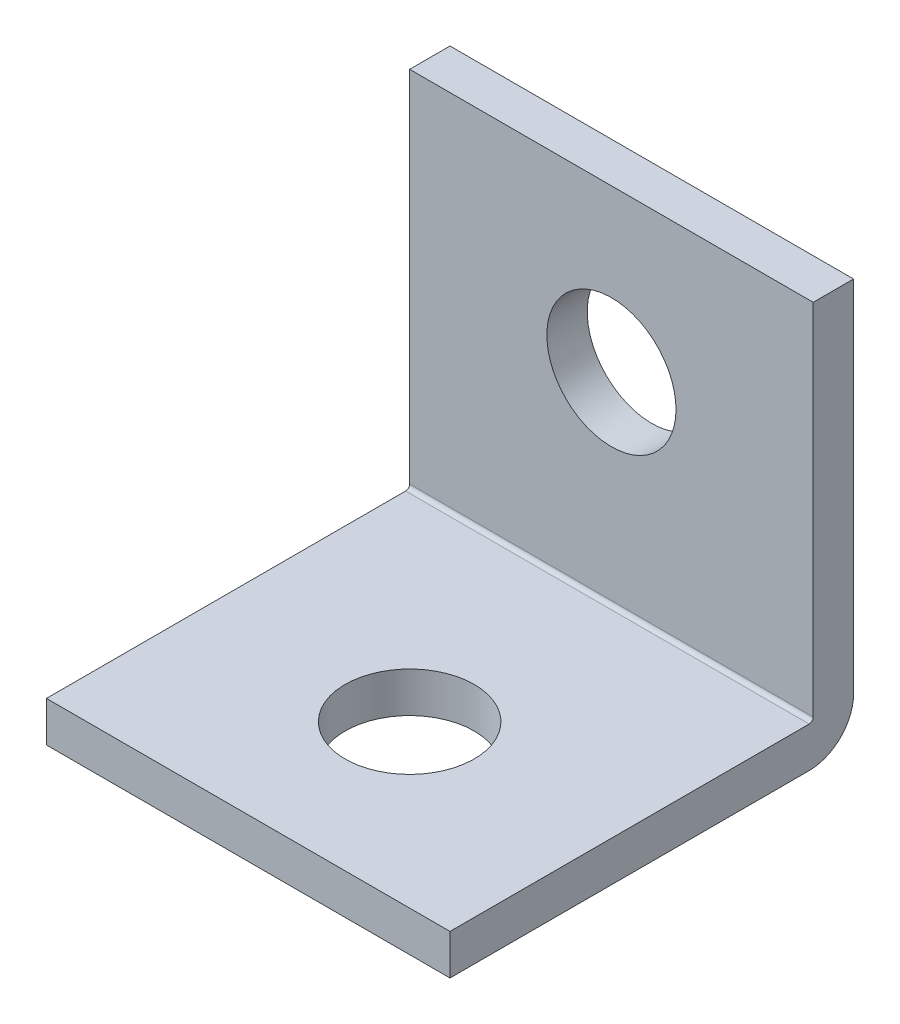
ISO-10303-21;
HEADER;
FILE_DESCRIPTION(('STEP AP214'),'2;1');
FILE_NAME('part.step','',(''),(''),'','','');
FILE_SCHEMA(('AUTOMOTIVE_DESIGN { 1 0 10303 214 1 1 1 1 }'));
ENDSEC;
DATA;
#1=APPLICATION_CONTEXT('core data for automotive mechanical design processes');
#2=APPLICATION_PROTOCOL_DEFINITION('international standard','automotive_design',2000,#1);
#3=PRODUCT_CONTEXT('',#1,'mechanical');
#4=PRODUCT('Part','Part','',(#3));
#5=PRODUCT_RELATED_PRODUCT_CATEGORY('part','',(#4));
#6=PRODUCT_DEFINITION_FORMATION('','',#4);
#7=PRODUCT_DEFINITION_CONTEXT('part definition',#1,'design');
#8=PRODUCT_DEFINITION('design','',#6,#7);
#9=PRODUCT_DEFINITION_SHAPE('','',#8);
#10=(LENGTH_UNIT() NAMED_UNIT(*) SI_UNIT(.MILLI.,.METRE.));
#11=(NAMED_UNIT(*) PLANE_ANGLE_UNIT() SI_UNIT($,.RADIAN.));
#12=(NAMED_UNIT(*) SI_UNIT($,.STERADIAN.) SOLID_ANGLE_UNIT());
#13=UNCERTAINTY_MEASURE_WITH_UNIT(LENGTH_MEASURE(1.E-05),#10,'distance_accuracy_value','');
#14=(GEOMETRIC_REPRESENTATION_CONTEXT(3) GLOBAL_UNCERTAINTY_ASSIGNED_CONTEXT((#13)) GLOBAL_UNIT_ASSIGNED_CONTEXT((#10,
#11,#12)) REPRESENTATION_CONTEXT('',''));
#15=CARTESIAN_POINT('',(0.,0.,0.));
#16=DIRECTION('',(0.,0.,1.));
#17=DIRECTION('',(1.,0.,0.));
#18=AXIS2_PLACEMENT_3D('',#15,#16,#17);
#19=CARTESIAN_POINT('',(0.,-5.,5.12588499176538));
#20=DIRECTION('',(0.,1.,0.));
#21=DIRECTION('',(0.,0.,1.));
#22=AXIS2_PLACEMENT_3D('',#19,#20,#21);
#23=PLANE('',#22);
#24=CARTESIAN_POINT('',(0.,-5.,6.));
#25=DIRECTION('',(0.,-1.,0.));
#26=DIRECTION('',(0.,0.,-1.));
#27=AXIS2_PLACEMENT_3D('',#24,#25,#26);
#28=CIRCLE('',#27,1.6);
#29=CARTESIAN_POINT('',(0.,-5.,4.4));
#30=VERTEX_POINT('',#29);
#31=EDGE_CURVE('E142',#30,#30,#28,.F.);
#32=ORIENTED_EDGE('',*,*,#31,.T.);
#33=EDGE_LOOP('',(#32));
#34=FACE_BOUND('',#33,.T.);
#35=DIRECTION('',(0.,0.,-1.));
#36=VECTOR('',#35,1.);
#37=CARTESIAN_POINT('',(5.,-5.,1.1));
#38=LINE('',#37,#36);
#39=CARTESIAN_POINT('',(4.99999999999999,-5.,10.));
#40=VERTEX_POINT('',#39);
#41=CARTESIAN_POINT('',(5.,-5.,1.1));
#42=VERTEX_POINT('',#41);
#43=EDGE_CURVE('E144',#40,#42,#38,.T.);
#44=ORIENTED_EDGE('',*,*,#43,.F.);
#45=DIRECTION('',(1.,0.,0.));
#46=VECTOR('',#45,1.);
#47=CARTESIAN_POINT('',(-5.,-5.,10.));
#48=LINE('',#47,#46);
#49=CARTESIAN_POINT('',(-5.,-5.,10.));
#50=VERTEX_POINT('',#49);
#51=EDGE_CURVE('E118',#50,#40,#48,.T.);
#52=ORIENTED_EDGE('',*,*,#51,.F.);
#53=DIRECTION('',(0.,0.,1.));
#54=VECTOR('',#53,1.);
#55=CARTESIAN_POINT('',(-5.,-5.,1.1));
#56=LINE('',#55,#54);
#57=CARTESIAN_POINT('',(-5.,-5.,1.1));
#58=VERTEX_POINT('',#57);
#59=EDGE_CURVE('E116',#58,#50,#56,.T.);
#60=ORIENTED_EDGE('',*,*,#59,.F.);
#61=DIRECTION('',(-1.,0.,0.));
#62=VECTOR('',#61,1.);
#63=CARTESIAN_POINT('',(0.,-5.,1.1));
#64=LINE('',#63,#62);
#65=EDGE_CURVE('E141',#42,#58,#64,.T.);
#66=ORIENTED_EDGE('',*,*,#65,.F.);
#67=EDGE_LOOP('',(#44,#52,#60,#66));
#68=FACE_BOUND('',#67,.T.);
#69=ADVANCED_FACE('F17',(#34,#68),#23,.F.);
#70=CARTESIAN_POINT('',(-5.,-4.,10.));
#71=DIRECTION('',(0.,0.,1.));
#72=DIRECTION('',(0.,-1.,0.));
#73=AXIS2_PLACEMENT_3D('',#70,#71,#72);
#74=PLANE('',#73);
#75=DIRECTION('',(1.,0.,0.));
#76=VECTOR('',#75,1.);
#77=CARTESIAN_POINT('',(0.,-4.,10.));
#78=LINE('',#77,#76);
#79=CARTESIAN_POINT('',(-5.,-4.,10.));
#80=VERTEX_POINT('',#79);
#81=CARTESIAN_POINT('',(4.99999999999999,-4.,10.));
#82=VERTEX_POINT('',#81);
#83=EDGE_CURVE('E97',#80,#82,#78,.T.);
#84=ORIENTED_EDGE('',*,*,#83,.F.);
#85=DIRECTION('',(0.,-1.,0.));
#86=VECTOR('',#85,1.);
#87=CARTESIAN_POINT('',(-5.,-4.,10.));
#88=LINE('',#87,#86);
#89=EDGE_CURVE('E93',#80,#50,#88,.T.);
#90=ORIENTED_EDGE('',*,*,#89,.T.);
#91=ORIENTED_EDGE('',*,*,#51,.T.);
#92=DIRECTION('',(0.,1.,0.));
#93=VECTOR('',#92,1.);
#94=CARTESIAN_POINT('',(4.99999999999999,-4.,10.));
#95=LINE('',#94,#93);
#96=EDGE_CURVE('E122',#82,#40,#95,.F.);
#97=ORIENTED_EDGE('',*,*,#96,.F.);
#98=EDGE_LOOP('',(#84,#90,#91,#97));
#99=FACE_BOUND('',#98,.T.);
#100=ADVANCED_FACE('F178',(#99),#74,.T.);
#101=CARTESIAN_POINT('',(0.,-4.,6.));
#102=DIRECTION('',(0.,-1.,0.));
#103=DIRECTION('',(0.,0.,-1.));
#104=AXIS2_PLACEMENT_3D('',#101,#102,#103);
#105=CYLINDRICAL_SURFACE('',#104,1.6);
#106=ORIENTED_EDGE('',*,*,#31,.F.);
#107=EDGE_LOOP('',(#106));
#108=FACE_BOUND('',#107,.T.);
#109=CARTESIAN_POINT('',(0.,-4.,6.));
#110=DIRECTION('',(0.,-1.,0.));
#111=DIRECTION('',(0.,0.,-1.));
#112=AXIS2_PLACEMENT_3D('',#109,#110,#111);
#113=CIRCLE('',#112,1.6);
#114=CARTESIAN_POINT('',(0.,-4.,4.4));
#115=VERTEX_POINT('',#114);
#116=EDGE_CURVE('E110',#115,#115,#113,.T.);
#117=ORIENTED_EDGE('',*,*,#116,.F.);
#118=EDGE_LOOP('',(#117));
#119=FACE_BOUND('',#118,.T.);
#120=ADVANCED_FACE('F224',(#108,#119),#105,.F.);
#121=CARTESIAN_POINT('',(0.,-3.9,1.1));
#122=DIRECTION('',(-1.,0.,0.));
#123=DIRECTION('',(0.,0.,1.));
#124=AXIS2_PLACEMENT_3D('',#121,#122,#123);
#125=CYLINDRICAL_SURFACE('',#124,1.1);
#126=DIRECTION('',(1.,0.,0.));
#127=VECTOR('',#126,1.);
#128=CARTESIAN_POINT('',(0.,-3.9,0.));
#129=LINE('',#128,#127);
#130=CARTESIAN_POINT('',(-5.,-3.9,0.));
#131=VERTEX_POINT('',#130);
#132=CARTESIAN_POINT('',(5.,-3.9,0.));
#133=VERTEX_POINT('',#132);
#134=EDGE_CURVE('E105',#131,#133,#129,.T.);
#135=ORIENTED_EDGE('',*,*,#134,.T.);
#136=CARTESIAN_POINT('',(5.,-3.9,1.1));
#137=DIRECTION('',(-1.,0.,0.));
#138=DIRECTION('',(0.,0.,1.));
#139=AXIS2_PLACEMENT_3D('',#136,#137,#138);
#140=CIRCLE('',#139,1.1);
#141=EDGE_CURVE('E98',#133,#42,#140,.T.);
#142=ORIENTED_EDGE('',*,*,#141,.T.);
#143=ORIENTED_EDGE('',*,*,#65,.T.);
#144=CARTESIAN_POINT('',(-5.,-3.9,1.1));
#145=DIRECTION('',(-1.,0.,0.));
#146=DIRECTION('',(0.,0.,1.));
#147=AXIS2_PLACEMENT_3D('',#144,#145,#146);
#148=CIRCLE('',#147,1.1);
#149=EDGE_CURVE('E139',#58,#131,#148,.F.);
#150=ORIENTED_EDGE('',*,*,#149,.T.);
#151=EDGE_LOOP('',(#135,#142,#143,#150));
#152=FACE_BOUND('',#151,.T.);
#153=ADVANCED_FACE('F183',(#152),#125,.T.);
#154=CARTESIAN_POINT('',(0.,-4.,5.12588499176538));
#155=DIRECTION('',(0.,1.,0.));
#156=DIRECTION('',(0.,0.,1.));
#157=AXIS2_PLACEMENT_3D('',#154,#155,#156);
#158=PLANE('',#157);
#159=ORIENTED_EDGE('',*,*,#116,.T.);
#160=EDGE_LOOP('',(#159));
#161=FACE_BOUND('',#160,.T.);
#162=ORIENTED_EDGE('',*,*,#83,.T.);
#163=DIRECTION('',(0.,0.,1.));
#164=VECTOR('',#163,1.);
#165=CARTESIAN_POINT('',(5.,-4.,5.12588499176538));
#166=LINE('',#165,#164);
#167=CARTESIAN_POINT('',(5.,-4.,1.1));
#168=VERTEX_POINT('',#167);
#169=EDGE_CURVE('E103',#82,#168,#166,.F.);
#170=ORIENTED_EDGE('',*,*,#169,.T.);
#171=DIRECTION('',(-1.,0.,0.));
#172=VECTOR('',#171,1.);
#173=CARTESIAN_POINT('',(0.,-4.,1.1));
#174=LINE('',#173,#172);
#175=CARTESIAN_POINT('',(-5.,-4.,1.1));
#176=VERTEX_POINT('',#175);
#177=EDGE_CURVE('E83',#168,#176,#174,.T.);
#178=ORIENTED_EDGE('',*,*,#177,.T.);
#179=DIRECTION('',(0.,0.,1.));
#180=VECTOR('',#179,1.);
#181=CARTESIAN_POINT('',(-5.,-4.,5.12588499176538));
#182=LINE('',#181,#180);
#183=EDGE_CURVE('E89',#176,#80,#182,.T.);
#184=ORIENTED_EDGE('',*,*,#183,.T.);
#185=EDGE_LOOP('',(#162,#170,#178,#184));
#186=FACE_BOUND('',#185,.T.);
#187=ADVANCED_FACE('F101',(#161,#186),#158,.T.);
#188=CARTESIAN_POINT('',(0.,0.,0.));
#189=DIRECTION('',(0.,0.,1.));
#190=DIRECTION('',(1.,0.,0.));
#191=AXIS2_PLACEMENT_3D('',#188,#189,#190);
#192=PLANE('',#191);
#193=CARTESIAN_POINT('',(0.,1.,0.));
#194=DIRECTION('',(0.,0.,1.));
#195=DIRECTION('',(1.,0.,0.));
#196=AXIS2_PLACEMENT_3D('',#193,#194,#195);
#197=CIRCLE('',#196,1.6);
#198=CARTESIAN_POINT('',(1.6,1.,0.));
#199=VERTEX_POINT('',#198);
#200=EDGE_CURVE('E130',#199,#199,#197,.T.);
#201=ORIENTED_EDGE('',*,*,#200,.T.);
#202=EDGE_LOOP('',(#201));
#203=FACE_BOUND('',#202,.T.);
#204=DIRECTION('',(0.,-1.,0.));
#205=VECTOR('',#204,1.);
#206=CARTESIAN_POINT('',(-5.,-5.,0.));
#207=LINE('',#206,#205);
#208=CARTESIAN_POINT('',(-5.,5.,0.));
#209=VERTEX_POINT('',#208);
#210=EDGE_CURVE('E135',#209,#131,#207,.T.);
#211=ORIENTED_EDGE('',*,*,#210,.F.);
#212=DIRECTION('',(1.,0.,0.));
#213=VECTOR('',#212,1.);
#214=CARTESIAN_POINT('',(-5.,5.,0.));
#215=LINE('',#214,#213);
#216=CARTESIAN_POINT('',(5.,5.,0.));
#217=VERTEX_POINT('',#216);
#218=EDGE_CURVE('E155',#217,#209,#215,.F.);
#219=ORIENTED_EDGE('',*,*,#218,.F.);
#220=DIRECTION('',(0.,1.,0.));
#221=VECTOR('',#220,1.);
#222=CARTESIAN_POINT('',(5.,5.,0.));
#223=LINE('',#222,#221);
#224=EDGE_CURVE('E104',#133,#217,#223,.T.);
#225=ORIENTED_EDGE('',*,*,#224,.F.);
#226=ORIENTED_EDGE('',*,*,#134,.F.);
#227=EDGE_LOOP('',(#211,#219,#225,#226));
#228=FACE_BOUND('',#227,.T.);
#229=ADVANCED_FACE('F188',(#203,#228),#192,.F.);
#230=CARTESIAN_POINT('',(0.,-3.9,1.1));
#231=DIRECTION('',(-1.,0.,0.));
#232=DIRECTION('',(0.,0.,1.));
#233=AXIS2_PLACEMENT_3D('',#230,#231,#232);
#234=CYLINDRICAL_SURFACE('',#233,0.1);
#235=CARTESIAN_POINT('',(5.,-3.9,1.1));
#236=DIRECTION('',(-1.,0.,0.));
#237=DIRECTION('',(0.,0.,1.));
#238=AXIS2_PLACEMENT_3D('',#235,#236,#237);
#239=CIRCLE('',#238,0.1);
#240=CARTESIAN_POINT('',(5.,-3.9,1.));
#241=VERTEX_POINT('',#240);
#242=EDGE_CURVE('E87',#241,#168,#239,.T.);
#243=ORIENTED_EDGE('',*,*,#242,.F.);
#244=DIRECTION('',(1.,0.,0.));
#245=VECTOR('',#244,1.);
#246=CARTESIAN_POINT('',(0.,-3.9,1.));
#247=LINE('',#246,#245);
#248=CARTESIAN_POINT('',(-5.,-3.9,1.));
#249=VERTEX_POINT('',#248);
#250=EDGE_CURVE('E85',#249,#241,#247,.T.);
#251=ORIENTED_EDGE('',*,*,#250,.F.);
#252=CARTESIAN_POINT('',(-5.,-3.9,1.1));
#253=DIRECTION('',(-1.,0.,0.));
#254=DIRECTION('',(0.,0.,1.));
#255=AXIS2_PLACEMENT_3D('',#252,#253,#254);
#256=CIRCLE('',#255,0.1);
#257=EDGE_CURVE('E20',#176,#249,#256,.F.);
#258=ORIENTED_EDGE('',*,*,#257,.F.);
#259=ORIENTED_EDGE('',*,*,#177,.F.);
#260=EDGE_LOOP('',(#243,#251,#258,#259));
#261=FACE_BOUND('',#260,.T.);
#262=ADVANCED_FACE('F81',(#261),#234,.F.);
#263=CARTESIAN_POINT('',(5.,5.,0.));
#264=DIRECTION('',(1.,0.,0.));
#265=DIRECTION('',(0.,1.,0.));
#266=AXIS2_PLACEMENT_3D('',#263,#264,#265);
#267=PLANE('',#266);
#268=DIRECTION('',(0.,0.,1.));
#269=VECTOR('',#268,1.);
#270=CARTESIAN_POINT('',(5.,5.,0.));
#271=LINE('',#270,#269);
#272=CARTESIAN_POINT('',(5.,5.,1.));
#273=VERTEX_POINT('',#272);
#274=EDGE_CURVE('E107',#273,#217,#271,.F.);
#275=ORIENTED_EDGE('',*,*,#274,.F.);
#276=DIRECTION('',(0.,1.,0.));
#277=VECTOR('',#276,1.);
#278=CARTESIAN_POINT('',(5.,0.,1.));
#279=LINE('',#278,#277);
#280=EDGE_CURVE('E125',#241,#273,#279,.T.);
#281=ORIENTED_EDGE('',*,*,#280,.F.);
#282=ORIENTED_EDGE('',*,*,#242,.T.);
#283=ORIENTED_EDGE('',*,*,#169,.F.);
#284=ORIENTED_EDGE('',*,*,#96,.T.);
#285=ORIENTED_EDGE('',*,*,#43,.T.);
#286=ORIENTED_EDGE('',*,*,#141,.F.);
#287=ORIENTED_EDGE('',*,*,#224,.T.);
#288=EDGE_LOOP('',(#275,#281,#282,#283,#284,#285,#286,#287));
#289=FACE_BOUND('',#288,.T.);
#290=ADVANCED_FACE('F147',(#289),#267,.T.);
#291=CARTESIAN_POINT('',(-5.,5.,0.));
#292=DIRECTION('',(0.,1.,0.));
#293=DIRECTION('',(0.,0.,1.));
#294=AXIS2_PLACEMENT_3D('',#291,#292,#293);
#295=PLANE('',#294);
#296=ORIENTED_EDGE('',*,*,#218,.T.);
#297=DIRECTION('',(0.,0.,1.));
#298=VECTOR('',#297,1.);
#299=CARTESIAN_POINT('',(-5.,5.,0.));
#300=LINE('',#299,#298);
#301=CARTESIAN_POINT('',(-5.,5.,1.));
#302=VERTEX_POINT('',#301);
#303=EDGE_CURVE('E35',#302,#209,#300,.F.);
#304=ORIENTED_EDGE('',*,*,#303,.F.);
#305=DIRECTION('',(1.,0.,0.));
#306=VECTOR('',#305,1.);
#307=CARTESIAN_POINT('',(0.,5.,1.));
#308=LINE('',#307,#306);
#309=EDGE_CURVE('E128',#273,#302,#308,.F.);
#310=ORIENTED_EDGE('',*,*,#309,.F.);
#311=ORIENTED_EDGE('',*,*,#274,.T.);
#312=EDGE_LOOP('',(#296,#304,#310,#311));
#313=FACE_BOUND('',#312,.T.);
#314=ADVANCED_FACE('F189',(#313),#295,.T.);
#315=CARTESIAN_POINT('',(-5.,-5.,0.));
#316=DIRECTION('',(-1.,0.,0.));
#317=DIRECTION('',(0.,-1.,0.));
#318=AXIS2_PLACEMENT_3D('',#315,#316,#317);
#319=PLANE('',#318);
#320=ORIENTED_EDGE('',*,*,#303,.T.);
#321=ORIENTED_EDGE('',*,*,#210,.T.);
#322=ORIENTED_EDGE('',*,*,#149,.F.);
#323=ORIENTED_EDGE('',*,*,#59,.T.);
#324=ORIENTED_EDGE('',*,*,#89,.F.);
#325=ORIENTED_EDGE('',*,*,#183,.F.);
#326=ORIENTED_EDGE('',*,*,#257,.T.);
#327=DIRECTION('',(0.,1.,0.));
#328=VECTOR('',#327,1.);
#329=CARTESIAN_POINT('',(-5.,0.,1.));
#330=LINE('',#329,#328);
#331=EDGE_CURVE('E26',#302,#249,#330,.F.);
#332=ORIENTED_EDGE('',*,*,#331,.F.);
#333=EDGE_LOOP('',(#320,#321,#322,#323,#324,#325,#326,#332));
#334=FACE_BOUND('',#333,.T.);
#335=ADVANCED_FACE('F90',(#334),#319,.T.);
#336=CARTESIAN_POINT('',(0.,1.,0.));
#337=DIRECTION('',(0.,0.,1.));
#338=DIRECTION('',(1.,0.,0.));
#339=AXIS2_PLACEMENT_3D('',#336,#337,#338);
#340=CYLINDRICAL_SURFACE('',#339,1.6);
#341=CARTESIAN_POINT('',(0.,1.,1.));
#342=DIRECTION('',(0.,0.,1.));
#343=DIRECTION('',(1.,0.,0.));
#344=AXIS2_PLACEMENT_3D('',#341,#342,#343);
#345=CIRCLE('',#344,1.6);
#346=CARTESIAN_POINT('',(1.6,1.,1.));
#347=VERTEX_POINT('',#346);
#348=EDGE_CURVE('E11',#347,#347,#345,.F.);
#349=ORIENTED_EDGE('',*,*,#348,.F.);
#350=EDGE_LOOP('',(#349));
#351=FACE_BOUND('',#350,.T.);
#352=ORIENTED_EDGE('',*,*,#200,.F.);
#353=EDGE_LOOP('',(#352));
#354=FACE_BOUND('',#353,.T.);
#355=ADVANCED_FACE('F197',(#351,#354),#340,.F.);
#356=CARTESIAN_POINT('',(0.,0.,1.));
#357=DIRECTION('',(0.,0.,1.));
#358=DIRECTION('',(1.,0.,0.));
#359=AXIS2_PLACEMENT_3D('',#356,#357,#358);
#360=PLANE('',#359);
#361=ORIENTED_EDGE('',*,*,#348,.T.);
#362=EDGE_LOOP('',(#361));
#363=FACE_BOUND('',#362,.T.);
#364=ORIENTED_EDGE('',*,*,#309,.T.);
#365=ORIENTED_EDGE('',*,*,#331,.T.);
#366=ORIENTED_EDGE('',*,*,#250,.T.);
#367=ORIENTED_EDGE('',*,*,#280,.T.);
#368=EDGE_LOOP('',(#364,#365,#366,#367));
#369=FACE_BOUND('',#368,.T.);
#370=ADVANCED_FACE('F151',(#363,#369),#360,.T.);
#371=CLOSED_SHELL('',(#69,#100,#120,#153,#187,#229,#262,#290,#314,#335,#355,#370));
#372=MANIFOLD_SOLID_BREP('B1',#371);
#373=ADVANCED_BREP_SHAPE_REPRESENTATION('',(#18,#372),#14);
#374=SHAPE_DEFINITION_REPRESENTATION(#9,#373);
ENDSEC;
END-ISO-10303-21;
